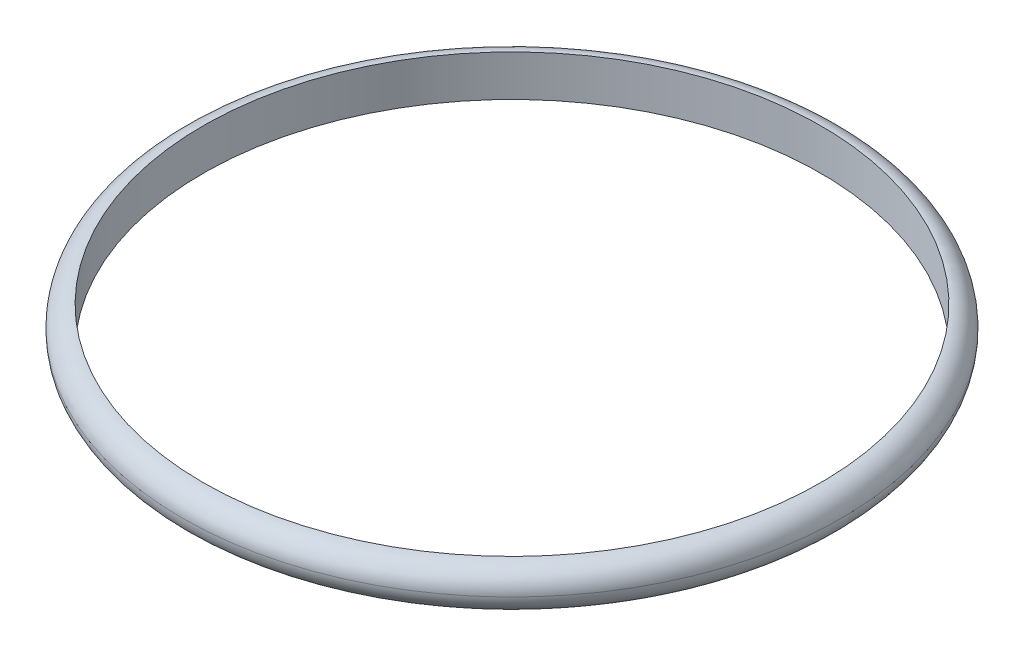
ISO-10303-21;
HEADER;
FILE_DESCRIPTION(('STEP AP214'),'2;1');
FILE_NAME('part.step','',(''),(''),'','','');
FILE_SCHEMA(('AUTOMOTIVE_DESIGN { 1 0 10303 214 1 1 1 1 }'));
ENDSEC;
DATA;
#1=APPLICATION_CONTEXT('core data for automotive mechanical design processes');
#2=APPLICATION_PROTOCOL_DEFINITION('international standard','automotive_design',2000,#1);
#3=PRODUCT_CONTEXT('',#1,'mechanical');
#4=PRODUCT('Part','Part','',(#3));
#5=PRODUCT_RELATED_PRODUCT_CATEGORY('part','',(#4));
#6=PRODUCT_DEFINITION_FORMATION('','',#4);
#7=PRODUCT_DEFINITION_CONTEXT('part definition',#1,'design');
#8=PRODUCT_DEFINITION('design','',#6,#7);
#9=PRODUCT_DEFINITION_SHAPE('','',#8);
#10=(LENGTH_UNIT() NAMED_UNIT(*) SI_UNIT(.MILLI.,.METRE.));
#11=(NAMED_UNIT(*) PLANE_ANGLE_UNIT() SI_UNIT($,.RADIAN.));
#12=(NAMED_UNIT(*) SI_UNIT($,.STERADIAN.) SOLID_ANGLE_UNIT());
#13=UNCERTAINTY_MEASURE_WITH_UNIT(LENGTH_MEASURE(1.E-05),#10,'distance_accuracy_value','');
#14=(GEOMETRIC_REPRESENTATION_CONTEXT(3) GLOBAL_UNCERTAINTY_ASSIGNED_CONTEXT((#13)) GLOBAL_UNIT_ASSIGNED_CONTEXT((#10,
#11,#12)) REPRESENTATION_CONTEXT('',''));
#15=CARTESIAN_POINT('',(0.,0.,0.));
#16=DIRECTION('',(0.,0.,1.));
#17=DIRECTION('',(1.,0.,0.));
#18=AXIS2_PLACEMENT_3D('',#15,#16,#17);
#19=CARTESIAN_POINT('',(0.,4.,0.));
#20=DIRECTION('',(0.,-1.,0.));
#21=DIRECTION('',(0.,0.,-1.));
#22=AXIS2_PLACEMENT_3D('',#19,#20,#21);
#23=CYLINDRICAL_SURFACE('',#22,30.);
#24=CARTESIAN_POINT('',(0.,4.,0.));
#25=DIRECTION('',(0.,1.,0.));
#26=DIRECTION('',(0.,0.,1.));
#27=AXIS2_PLACEMENT_3D('',#24,#25,#26);
#28=CIRCLE('',#27,30.);
#29=CARTESIAN_POINT('',(0.,4.,30.));
#30=VERTEX_POINT('',#29);
#31=EDGE_CURVE('E10',#30,#30,#28,.T.);
#32=ORIENTED_EDGE('',*,*,#31,.T.);
#33=EDGE_LOOP('',(#32));
#34=FACE_BOUND('',#33,.T.);
#35=CARTESIAN_POINT('',(0.,0.,0.));
#36=DIRECTION('',(0.,1.,0.));
#37=DIRECTION('',(0.,0.,1.));
#38=AXIS2_PLACEMENT_3D('',#35,#36,#37);
#39=CIRCLE('',#38,30.);
#40=CARTESIAN_POINT('',(0.,0.,30.));
#41=VERTEX_POINT('',#40);
#42=EDGE_CURVE('E37',#41,#41,#39,.T.);
#43=ORIENTED_EDGE('',*,*,#42,.F.);
#44=EDGE_LOOP('',(#43));
#45=FACE_BOUND('',#44,.T.);
#46=ADVANCED_FACE('F29',(#34,#45),#23,.F.);
#47=CARTESIAN_POINT('',(0.,2.,0.));
#48=DIRECTION('',(0.,1.,0.));
#49=DIRECTION('',(0.,0.,1.));
#50=AXIS2_PLACEMENT_3D('',#47,#48,#49);
#51=TOROIDAL_SURFACE('',#50,30.,2.);
#52=ORIENTED_EDGE('',*,*,#31,.F.);
#53=EDGE_LOOP('',(#52));
#54=FACE_BOUND('',#53,.T.);
#55=CARTESIAN_POINT('',(0.,2.,0.));
#56=DIRECTION('',(0.,1.,0.));
#57=DIRECTION('',(0.,0.,1.));
#58=AXIS2_PLACEMENT_3D('',#55,#56,#57);
#59=CIRCLE('',#58,32.);
#60=CARTESIAN_POINT('',(0.,2.,32.));
#61=VERTEX_POINT('',#60);
#62=EDGE_CURVE('E33',#61,#61,#59,.F.);
#63=ORIENTED_EDGE('',*,*,#62,.F.);
#64=EDGE_LOOP('',(#63));
#65=FACE_BOUND('',#64,.T.);
#66=ADVANCED_FACE('F31',(#54,#65),#51,.T.);
#67=CARTESIAN_POINT('',(0.,2.,0.));
#68=DIRECTION('',(0.,1.,0.));
#69=DIRECTION('',(0.,0.,1.));
#70=AXIS2_PLACEMENT_3D('',#67,#68,#69);
#71=TOROIDAL_SURFACE('',#70,30.,2.);
#72=ORIENTED_EDGE('',*,*,#42,.T.);
#73=EDGE_LOOP('',(#72));
#74=FACE_BOUND('',#73,.T.);
#75=ORIENTED_EDGE('',*,*,#62,.T.);
#76=EDGE_LOOP('',(#75));
#77=FACE_BOUND('',#76,.T.);
#78=ADVANCED_FACE('F47',(#74,#77),#71,.T.);
#79=CLOSED_SHELL('',(#46,#66,#78));
#80=MANIFOLD_SOLID_BREP('B2',#79);
#81=ADVANCED_BREP_SHAPE_REPRESENTATION('',(#18,#80),#14);
#82=SHAPE_DEFINITION_REPRESENTATION(#9,#81);
ENDSEC;
END-ISO-10303-21;
